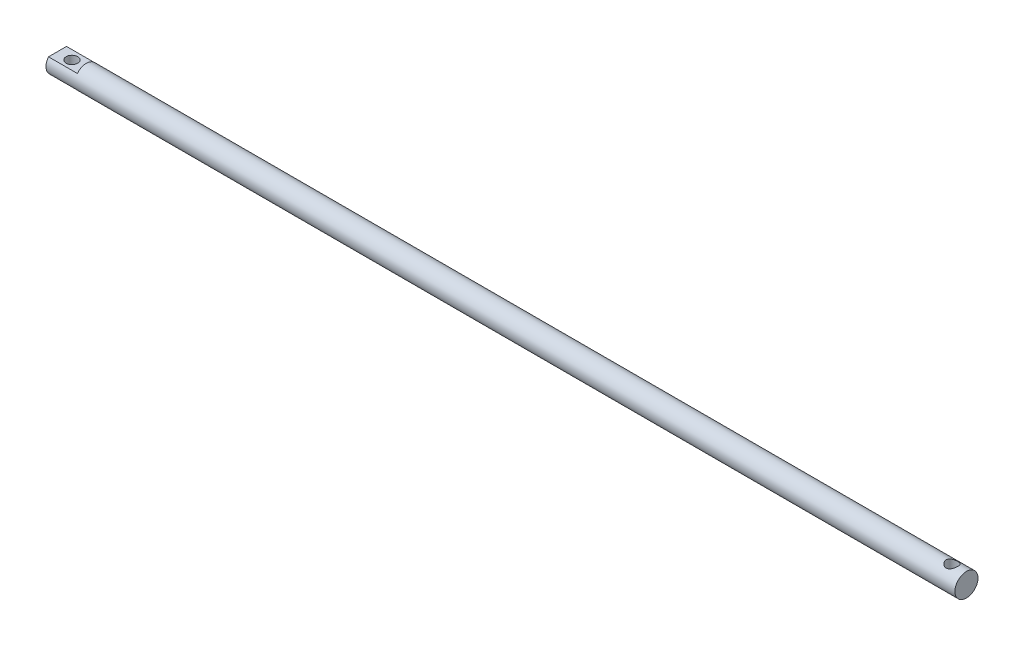
ISO-10303-21;
HEADER;
FILE_DESCRIPTION(('STEP AP214'),'2;1');
FILE_NAME('part.step','',(''),(''),'','','');
FILE_SCHEMA(('AUTOMOTIVE_DESIGN { 1 0 10303 214 1 1 1 1 }'));
ENDSEC;
DATA;
#1=APPLICATION_CONTEXT('core data for automotive mechanical design processes');
#2=APPLICATION_PROTOCOL_DEFINITION('international standard','automotive_design',2000,#1);
#3=PRODUCT_CONTEXT('',#1,'mechanical');
#4=PRODUCT('Part','Part','',(#3));
#5=PRODUCT_RELATED_PRODUCT_CATEGORY('part','',(#4));
#6=PRODUCT_DEFINITION_FORMATION('','',#4);
#7=PRODUCT_DEFINITION_CONTEXT('part definition',#1,'design');
#8=PRODUCT_DEFINITION('design','',#6,#7);
#9=PRODUCT_DEFINITION_SHAPE('','',#8);
#10=(LENGTH_UNIT() NAMED_UNIT(*) SI_UNIT(.MILLI.,.METRE.));
#11=(NAMED_UNIT(*) PLANE_ANGLE_UNIT() SI_UNIT($,.RADIAN.));
#12=(NAMED_UNIT(*) SI_UNIT($,.STERADIAN.) SOLID_ANGLE_UNIT());
#13=UNCERTAINTY_MEASURE_WITH_UNIT(LENGTH_MEASURE(1.E-05),#10,'distance_accuracy_value','');
#14=(GEOMETRIC_REPRESENTATION_CONTEXT(3) GLOBAL_UNCERTAINTY_ASSIGNED_CONTEXT((#13)) GLOBAL_UNIT_ASSIGNED_CONTEXT((#10,
#11,#12)) REPRESENTATION_CONTEXT('',''));
#15=CARTESIAN_POINT('',(0.,0.,0.));
#16=DIRECTION('',(0.,0.,1.));
#17=DIRECTION('',(1.,0.,0.));
#18=AXIS2_PLACEMENT_3D('',#15,#16,#17);
#19=CARTESIAN_POINT('',(630.,0.,0.));
#20=DIRECTION('',(-1.,0.,0.));
#21=DIRECTION('',(0.,0.,1.));
#22=AXIS2_PLACEMENT_3D('',#19,#20,#21);
#23=CYLINDRICAL_SURFACE('',#22,8.);
#24=CARTESIAN_POINT('',(620.,-6.92820323027551,3.99999999999999));
#25=CARTESIAN_POINT('',(620.104265325437,-6.92820386262827,3.99999950219344));
#26=CARTESIAN_POINT('',(620.208539926679,-6.93056511456489,3.99591763199539));
#27=CARTESIAN_POINT('',(620.4162841746,-6.93992172463862,3.97964472112407));
#28=CARTESIAN_POINT('',(620.519753423833,-6.94691924018482,3.96744990521398));
#29=CARTESIAN_POINT('',(620.72521084557,-6.96530330045204,3.9350853829752));
#30=CARTESIAN_POINT('',(620.827196433829,-6.97669672816264,3.91490316893161));
#31=CARTESIAN_POINT('',(621.028814001678,-7.00345973447506,3.86682062971256));
#32=CARTESIAN_POINT('',(621.128444938043,-7.01883104071992,3.8389169506412));
#33=CARTESIAN_POINT('',(621.421688966009,-7.06996541785761,3.74442772916635));
#34=CARTESIAN_POINT('',(621.610985856617,-7.11087904783326,3.66684915651284));
#35=CARTESIAN_POINT('',(621.973729563801,-7.20170927952069,3.48506075380106));
#36=CARTESIAN_POINT('',(622.147175522219,-7.25162636823863,3.38084948302613));
#37=CARTESIAN_POINT('',(622.489208494348,-7.35987226264081,3.13867639492102));
#38=CARTESIAN_POINT('',(622.656214866448,-7.41855528289905,2.99863981046007));
#39=CARTESIAN_POINT('',(622.965655240649,-7.53488657765781,2.69298354883075));
#40=CARTESIAN_POINT('',(623.108076985764,-7.59253432325008,2.52735118809494));
#41=CARTESIAN_POINT('',(623.304982066482,-7.67587593559649,2.25626437810996));
#42=CARTESIAN_POINT('',(623.369532261619,-7.70394919240217,2.15870290429521));
#43=CARTESIAN_POINT('',(623.490104440228,-7.7574419379606,1.9577742706589));
#44=CARTESIAN_POINT('',(623.546130046009,-7.78286255243592,1.85440960246331));
#45=CARTESIAN_POINT('',(623.649112781658,-7.83032159918278,1.64251485422612));
#46=CARTESIAN_POINT('',(623.69607005259,-7.8523600840649,1.53398485456807));
#47=CARTESIAN_POINT('',(623.780361948266,-7.89238619731917,1.31258580967497));
#48=CARTESIAN_POINT('',(623.817701987689,-7.91037610439246,1.19971924732424));
#49=CARTESIAN_POINT('',(623.880018294275,-7.94064573590695,0.978622575683345));
#50=CARTESIAN_POINT('',(623.905682153058,-7.95323930006916,0.870629018183781));
#51=CARTESIAN_POINT('',(623.947979707433,-7.97409583861316,0.6525240884358));
#52=CARTESIAN_POINT('',(623.964617821516,-7.98236093189931,0.542413779814487));
#53=CARTESIAN_POINT('',(623.988655866998,-7.99432715952591,0.320973525125407));
#54=CARTESIAN_POINT('',(623.996058446716,-7.99802960221736,0.209643937931292));
#55=CARTESIAN_POINT('',(624.00153168637,-8.0007656004484,-0.0132971447801192));
#56=CARTESIAN_POINT('',(623.999602917245,-7.99979944163708,-0.124908622632265));
#57=CARTESIAN_POINT('',(623.987014791293,-7.99351360464186,-0.337727985342387));
#58=CARTESIAN_POINT('',(623.977131977651,-7.98858118408678,-0.43899381771691));
#59=CARTESIAN_POINT('',(623.949736720904,-7.97497880011988,-0.640243249291336));
#60=CARTESIAN_POINT('',(623.932221820864,-7.96630763313356,-0.74022642489705));
#61=CARTESIAN_POINT('',(623.868489477306,-7.93497195498556,-1.03714138295467));
#62=CARTESIAN_POINT('',(623.811072102999,-7.9069787607081,-1.23123936013568));
#63=CARTESIAN_POINT('',(623.667666026114,-7.83886272517952,-1.60926871560137));
#64=CARTESIAN_POINT('',(623.581293017597,-7.79857742343274,-1.79302228049011));
#65=CARTESIAN_POINT('',(623.382948065529,-7.70950607728794,-2.14389861654607));
#66=CARTESIAN_POINT('',(623.270966957186,-7.66071699099023,-2.31101540282592));
#67=CARTESIAN_POINT('',(623.012415080003,-7.55377539869558,-2.64069813790283));
#68=CARTESIAN_POINT('',(622.863575239847,-7.49517374441382,-2.80134064782811));
#69=CARTESIAN_POINT('',(622.541653756814,-7.37817491997776,-3.09641313015096));
#70=CARTESIAN_POINT('',(622.368553637176,-7.31977794078034,-3.23082293513639));
#71=CARTESIAN_POINT('',(621.989357111332,-7.20576112808084,-3.4780361331416));
#72=CARTESIAN_POINT('',(621.781863381452,-7.15055315383101,-3.58892539602574));
#73=CARTESIAN_POINT('',(621.456582615561,-7.07886925416586,-3.72723782010751));
#74=CARTESIAN_POINT('',(621.345791640803,-7.05682593849465,-3.76867730715222));
#75=CARTESIAN_POINT('',(621.120255153219,-7.01731299636542,-3.84175062064904));
#76=CARTESIAN_POINT('',(621.005512127474,-6.99984055082838,-3.87339049322798));
#77=CARTESIAN_POINT('',(620.782171335483,-6.97140602598867,-3.92431909326376));
#78=CARTESIAN_POINT('',(620.67380134854,-6.96003957007805,-3.94438433855717));
#79=CARTESIAN_POINT('',(620.455419099522,-6.94230335544128,-3.97551851361913));
#80=CARTESIAN_POINT('',(620.345407721866,-6.93593099829036,-3.98659212183614));
#81=CARTESIAN_POINT('',(620.124707489967,-6.92844811909924,-3.99958291311108));
#82=CARTESIAN_POINT('',(620.014018903373,-6.92733563775176,-4.00150350567567));
#83=CARTESIAN_POINT('',(619.792943306894,-6.93041539174956,-3.99616718095744));
#84=CARTESIAN_POINT('',(619.682556277157,-6.93460726902939,-3.98891088315149));
#85=CARTESIAN_POINT('',(619.47513061602,-6.94737197203376,-3.96663154579714));
#86=CARTESIAN_POINT('',(619.377956788988,-6.95541341326253,-3.95254845698988));
#87=CARTESIAN_POINT('',(619.185268066566,-6.97528372672039,-3.91737385475212));
#88=CARTESIAN_POINT('',(619.089753729964,-6.98711384958698,-3.89628002700137));
#89=CARTESIAN_POINT('',(618.806631963892,-7.02775685901552,-3.82280238446318));
#90=CARTESIAN_POINT('',(618.622308565727,-7.06173163693375,-3.76020731695081));
#91=CARTESIAN_POINT('',(618.258325412299,-7.14144993292039,-3.60658595732558));
#92=CARTESIAN_POINT('',(618.079277046661,-7.18766564346823,-3.51437713951612));
#93=CARTESIAN_POINT('',(617.738129803313,-7.28624486618863,-3.30514737086273));
#94=CARTESIAN_POINT('',(617.576039696692,-7.33861153030437,-3.18811367399411));
#95=CARTESIAN_POINT('',(617.252086877142,-7.45151836616993,-2.91535761342629));
#96=CARTESIAN_POINT('',(617.092828412834,-7.51225675092662,-2.75661800037809));
#97=CARTESIAN_POINT('',(616.802334026584,-7.62937597657744,-2.41358105803057));
#98=CARTESIAN_POINT('',(616.671107570384,-7.68575534144674,-2.22927513013704));
#99=CARTESIAN_POINT('',(616.496792217763,-7.76335543938378,-1.9341922540815));
#100=CARTESIAN_POINT('',(616.441869942701,-7.78834354202674,-1.83122945254027));
#101=CARTESIAN_POINT('',(616.340994469123,-7.83494183925331,-1.62028527572801));
#102=CARTESIAN_POINT('',(616.295037236862,-7.85655355213899,-1.51230618469747));
#103=CARTESIAN_POINT('',(616.21262567336,-7.8957515201521,-1.29213403393071));
#104=CARTESIAN_POINT('',(616.17616684182,-7.91333968113672,-1.17994299872757));
#105=CARTESIAN_POINT('',(616.113192739054,-7.94396070933363,-0.952197786602007));
#106=CARTESIAN_POINT('',(616.086676288706,-7.95699411670659,-0.836644010238153));
#107=CARTESIAN_POINT('',(616.045927950053,-7.97711749125789,-0.613942900584725));
#108=CARTESIAN_POINT('',(616.030790527224,-7.98464383966398,-0.506999857370298));
#109=CARTESIAN_POINT('',(616.009207886647,-7.99539449729097,-0.291983714868753));
#110=CARTESIAN_POINT('',(616.002765563629,-7.99861737381754,-0.183910251308602));
#111=CARTESIAN_POINT('',(615.998669857914,-8.00066496370437,0.0323692027916044));
#112=CARTESIAN_POINT('',(616.001010388416,-7.99949272302419,0.14057504961526));
#113=CARTESIAN_POINT('',(616.014437670826,-7.99278884324615,0.356345776551083));
#114=CARTESIAN_POINT('',(616.025527627864,-7.9872556066098,0.463910407218392));
#115=CARTESIAN_POINT('',(616.05529397739,-7.97248705040341,0.670402230454391));
#116=CARTESIAN_POINT('',(616.073417848704,-7.96352188946078,0.7694287713797));
#117=CARTESIAN_POINT('',(616.116969937488,-7.94213883037983,0.965494016558211));
#118=CARTESIAN_POINT('',(616.142400649174,-7.92971975328176,1.06253202988242));
#119=CARTESIAN_POINT('',(616.229286595751,-7.88769036296796,1.34967669515379));
#120=CARTESIAN_POINT('',(616.30136154016,-7.85329454083083,1.53599051531896));
#121=CARTESIAN_POINT('',(616.474913777281,-7.77303546188783,1.90172389087133));
#122=CARTESIAN_POINT('',(616.577516772334,-7.72674465907379,2.08050775123495));
#123=CARTESIAN_POINT('',(616.807832244173,-7.62752535456451,2.41909138351713));
#124=CARTESIAN_POINT('',(616.935556253632,-7.57459380826237,2.57888238184506));
#125=CARTESIAN_POINT('',(617.227180136878,-7.46114622775075,2.89165430996831));
#126=CARTESIAN_POINT('',(617.393415226836,-7.40039963213061,3.04237488708298));
#127=CARTESIAN_POINT('',(617.749837638172,-7.28251536809496,3.31466901461287));
#128=CARTESIAN_POINT('',(617.940045925249,-7.22538092516391,3.43621677845463));
#129=CARTESIAN_POINT('',(618.243375736153,-7.14673032771599,3.59554085555897));
#130=CARTESIAN_POINT('',(618.349301068268,-7.12134958638074,3.64540546855453));
#131=CARTESIAN_POINT('',(618.565804376965,-7.07430377646636,3.7358834166029));
#132=CARTESIAN_POINT('',(618.676379922062,-7.05263679540785,3.77650151690077));
#133=CARTESIAN_POINT('',(618.901126299433,-7.01393620687007,3.84790167044832));
#134=CARTESIAN_POINT('',(619.015287034468,-6.99689069691892,3.87870902746068));
#135=CARTESIAN_POINT('',(619.246473715577,-6.96811827819218,3.9301656885662));
#136=CARTESIAN_POINT('',(619.363497598088,-6.95638765128934,3.95082209480825));
#137=CARTESIAN_POINT('',(619.567198309544,-6.9411803288909,3.97745846425996));
#138=CARTESIAN_POINT('',(619.653459372982,-6.93632575562014,3.98590343866332));
#139=CARTESIAN_POINT('',(619.826478127986,-6.92983683549392,3.99717460159987));
#140=CARTESIAN_POINT('',(619.913235852386,-6.92820270406464,4.00000041424856));
#141=CARTESIAN_POINT('',(620.,-6.92820323027551,3.99999999999999));
#142=B_SPLINE_CURVE_WITH_KNOTS('',3,(#24,#25,#26,#27,#28,#29,#30,#31,#32,#33,#34,#35,#36,#37,
#38,#39,#40,#41,#42,#43,#44,#45,#46,#47,#48,#49,#50,#51,#52,#53,#54,#55,#56,#57,#58,#59,#60,#61,
#62,#63,#64,#65,#66,#67,#68,#69,#70,#71,#72,#73,#74,#75,#76,#77,#78,#79,#80,#81,#82,#83,#84,#85,
#86,#87,#88,#89,#90,#91,#92,#93,#94,#95,#96,#97,#98,#99,#100,#101,#102,#103,#104,#105,#106,#107,
#108,#109,#110,#111,#112,#113,#114,#115,#116,#117,#118,#119,#120,#121,#122,#123,#124,#125,#126,
#127,#128,#129,#130,#131,#132,#133,#134,#135,#136,#137,#138,#139,#140,#141),.UNSPECIFIED.,.T.,
.F.,(4,2,2,2,2,2,2,2,2,2,2,2,2,2,2,2,2,2,2,2,2,2,2,2,2,2,2,2,2,2,2,2,2,2,2,2,2,2,2,2,2,2,2,2,2,
2,2,2,2,2,2,2,2,2,2,2,2,2,4),(0.,0.312705907645127,0.625557430139106,0.938900807369748,
1.25238050266333,1.8753233150872,2.49829983322605,3.17265818143843,3.84735177482024,
4.20786878872681,4.56823217961293,4.92858996431108,5.28874441516642,5.62343001077667,
5.95795161516739,6.29237727234825,6.6267824679036,6.93200651230817,7.23732888766057,
7.84737748897723,8.46586637752485,9.08457696228989,9.76177264655461,10.4394869181158,
11.1602386574569,11.5207615871967,11.8810616378013,12.2129840588139,12.5447336660447,
12.8763596865808,13.2079633222266,13.5031682056198,13.7984706362684,14.3886653967499,
15.0061951555508,15.6240427481094,16.319773042532,17.0157378984355,17.3733524504476,
17.7308057238246,18.0880893282017,18.44533054695,18.7697157004161,19.0942088199643,
19.4184770967801,19.7428642161658,20.0457160884446,20.3486714633267,20.9540518089476,
21.5853244972459,22.2168876724957,22.9113041424698,23.6063321822732,23.9652997079033,
24.3240818165632,24.6819309195697,25.0395292944429,25.2997293817867,25.5599468741983),.UNSPECIFIED.);
#143=CARTESIAN_POINT('',(620.,-6.92820323027551,3.99999999999999));
#144=VERTEX_POINT('',#143);
#145=EDGE_CURVE('E106',#144,#144,#142,.T.);
#146=ORIENTED_EDGE('',*,*,#145,.T.);
#147=EDGE_LOOP('',(#146));
#148=FACE_BOUND('',#147,.T.);
#149=CARTESIAN_POINT('',(620.,6.92820323027551,3.99999999999999));
#150=CARTESIAN_POINT('',(619.895734674563,6.92820386262827,3.99999950219344));
#151=CARTESIAN_POINT('',(619.791460073321,6.93056511456489,3.99591763199539));
#152=CARTESIAN_POINT('',(619.5837158254,6.93992172463862,3.97964472112407));
#153=CARTESIAN_POINT('',(619.480246576167,6.94691924018482,3.96744990521398));
#154=CARTESIAN_POINT('',(619.27478915443,6.96530330045204,3.9350853829752));
#155=CARTESIAN_POINT('',(619.17280356617,6.97669672816264,3.91490316893161));
#156=CARTESIAN_POINT('',(618.971185998322,7.00345973447506,3.86682062971256));
#157=CARTESIAN_POINT('',(618.871555061957,7.01883104071992,3.8389169506412));
#158=CARTESIAN_POINT('',(618.578311033991,7.06996541785761,3.74442772916635));
#159=CARTESIAN_POINT('',(618.389014143383,7.11087904783326,3.66684915651284));
#160=CARTESIAN_POINT('',(618.026270436199,7.20170927952069,3.48506075380106));
#161=CARTESIAN_POINT('',(617.852824477781,7.25162636823862,3.38084948302614));
#162=CARTESIAN_POINT('',(617.510791505652,7.35987226264081,3.13867639492104));
#163=CARTESIAN_POINT('',(617.343785133553,7.41855528289904,2.99863981046009));
#164=CARTESIAN_POINT('',(617.034344759351,7.5348865776578,2.69298354883079));
#165=CARTESIAN_POINT('',(616.891923014236,7.59253432325007,2.52735118809498));
#166=CARTESIAN_POINT('',(616.695017933518,7.67587593559649,2.25626437810994));
#167=CARTESIAN_POINT('',(616.630467738381,7.70394919240219,2.15870290429515));
#168=CARTESIAN_POINT('',(616.509895559772,7.75744193796062,1.95777427065883));
#169=CARTESIAN_POINT('',(616.453869953991,7.78286255243593,1.85440960246328));
#170=CARTESIAN_POINT('',(616.350887218342,7.83032159918278,1.64251485422613));
#171=CARTESIAN_POINT('',(616.30392994741,7.85236008406491,1.53398485456807));
#172=CARTESIAN_POINT('',(616.219638051734,7.89238619731918,1.31258580967496));
#173=CARTESIAN_POINT('',(616.182298012311,7.91037610439246,1.19971924732424));
#174=CARTESIAN_POINT('',(616.119981705725,7.94064573590695,0.978622575683346));
#175=CARTESIAN_POINT('',(616.094317846942,7.95323930006916,0.870629018183781));
#176=CARTESIAN_POINT('',(616.052020292567,7.97409583861316,0.6525240884358));
#177=CARTESIAN_POINT('',(616.035382178484,7.98236093189931,0.542413779814487));
#178=CARTESIAN_POINT('',(616.011344133002,7.99432715952591,0.320973525125406));
#179=CARTESIAN_POINT('',(616.003941553284,7.99802960221736,0.209643937931292));
#180=CARTESIAN_POINT('',(615.99846831363,8.0007656004484,-0.0132971447801192));
#181=CARTESIAN_POINT('',(616.000397082755,7.99979944163708,-0.124908622632265));
#182=CARTESIAN_POINT('',(616.012985208707,7.99351360464186,-0.337727985342387));
#183=CARTESIAN_POINT('',(616.022868022349,7.98858118408678,-0.43899381771691));
#184=CARTESIAN_POINT('',(616.050263279096,7.97497880011988,-0.640243249291336));
#185=CARTESIAN_POINT('',(616.067778179136,7.96630763313356,-0.74022642489705));
#186=CARTESIAN_POINT('',(616.131510522694,7.93497195498556,-1.03714138295467));
#187=CARTESIAN_POINT('',(616.188927897001,7.9069787607081,-1.23123936013568));
#188=CARTESIAN_POINT('',(616.332333973886,7.83886272517952,-1.60926871560137));
#189=CARTESIAN_POINT('',(616.418706982403,7.79857742343274,-1.79302228049011));
#190=CARTESIAN_POINT('',(616.617051934471,7.70950607728794,-2.14389861654607));
#191=CARTESIAN_POINT('',(616.729033042814,7.66071699099023,-2.31101540282592));
#192=CARTESIAN_POINT('',(616.987584919997,7.55377539869558,-2.64069813790283));
#193=CARTESIAN_POINT('',(617.136424760153,7.49517374441382,-2.80134064782811));
#194=CARTESIAN_POINT('',(617.458346243186,7.37817491997776,-3.09641313015096));
#195=CARTESIAN_POINT('',(617.631446362824,7.31977794078034,-3.23082293513639));
#196=CARTESIAN_POINT('',(618.010642888668,7.20576112808084,-3.4780361331416));
#197=CARTESIAN_POINT('',(618.218136618548,7.15055315383101,-3.58892539602574));
#198=CARTESIAN_POINT('',(618.543417384439,7.07886925416586,-3.72723782010751));
#199=CARTESIAN_POINT('',(618.654208359197,7.05682593849465,-3.76867730715222));
#200=CARTESIAN_POINT('',(618.879744846781,7.01731299636542,-3.84175062064904));
#201=CARTESIAN_POINT('',(618.994487872526,6.99984055082838,-3.87339049322798));
#202=CARTESIAN_POINT('',(619.217828664517,6.97140602598867,-3.92431909326376));
#203=CARTESIAN_POINT('',(619.32619865146,6.96003957007805,-3.94438433855717));
#204=CARTESIAN_POINT('',(619.544580900478,6.94230335544128,-3.97551851361913));
#205=CARTESIAN_POINT('',(619.654592278134,6.93593099829036,-3.98659212183614));
#206=CARTESIAN_POINT('',(619.875292510033,6.92844811909924,-3.99958291311108));
#207=CARTESIAN_POINT('',(619.985981096627,6.92733563775176,-4.00150350567567));
#208=CARTESIAN_POINT('',(620.207056693106,6.93041539174956,-3.99616718095744));
#209=CARTESIAN_POINT('',(620.317443722843,6.93460726902939,-3.98891088315149));
#210=CARTESIAN_POINT('',(620.52486938398,6.94737197203376,-3.96663154579714));
#211=CARTESIAN_POINT('',(620.622043211012,6.95541341326253,-3.95254845698988));
#212=CARTESIAN_POINT('',(620.814731933434,6.97528372672039,-3.91737385475212));
#213=CARTESIAN_POINT('',(620.910246270036,6.98711384958698,-3.89628002700137));
#214=CARTESIAN_POINT('',(621.193368036108,7.02775685901552,-3.82280238446318));
#215=CARTESIAN_POINT('',(621.377691434273,7.06173163693375,-3.76020731695081));
#216=CARTESIAN_POINT('',(621.741674587701,7.14144993292039,-3.60658595732558));
#217=CARTESIAN_POINT('',(621.920722953339,7.18766564346823,-3.51437713951612));
#218=CARTESIAN_POINT('',(622.261870196687,7.28624486618863,-3.30514737086273));
#219=CARTESIAN_POINT('',(622.423960303308,7.33861153030437,-3.18811367399411));
#220=CARTESIAN_POINT('',(622.747913122858,7.45151836616993,-2.91535761342629));
#221=CARTESIAN_POINT('',(622.907171587166,7.51225675092662,-2.75661800037809));
#222=CARTESIAN_POINT('',(623.197665973416,7.62937597657744,-2.41358105803057));
#223=CARTESIAN_POINT('',(623.328892429616,7.68575534144674,-2.22927513013704));
#224=CARTESIAN_POINT('',(623.503207782237,7.76335543938378,-1.9341922540815));
#225=CARTESIAN_POINT('',(623.558130057299,7.78834354202674,-1.83122945254027));
#226=CARTESIAN_POINT('',(623.659005530877,7.83494183925331,-1.62028527572801));
#227=CARTESIAN_POINT('',(623.704962763138,7.85655355213899,-1.51230618469747));
#228=CARTESIAN_POINT('',(623.78737432664,7.8957515201521,-1.29213403393071));
#229=CARTESIAN_POINT('',(623.82383315818,7.91333968113672,-1.17994299872757));
#230=CARTESIAN_POINT('',(623.886807260946,7.94396070933363,-0.952197786602007));
#231=CARTESIAN_POINT('',(623.913323711294,7.95699411670659,-0.836644010238153));
#232=CARTESIAN_POINT('',(623.954072049947,7.97711749125789,-0.613942900584721));
#233=CARTESIAN_POINT('',(623.969209472776,7.98464383966398,-0.506999857370291));
#234=CARTESIAN_POINT('',(623.990792113353,7.99539449729097,-0.291983714868746));
#235=CARTESIAN_POINT('',(623.997234436371,7.99861737381754,-0.183910251308599));
#236=CARTESIAN_POINT('',(624.001330142086,8.00066496370437,0.0323692027916044));
#237=CARTESIAN_POINT('',(623.998989611584,7.99949272302419,0.14057504961526));
#238=CARTESIAN_POINT('',(623.985562329174,7.99278884324615,0.356345776551083));
#239=CARTESIAN_POINT('',(623.974472372136,7.9872556066098,0.463910407218392));
#240=CARTESIAN_POINT('',(623.94470602261,7.97248705040341,0.670402230454392));
#241=CARTESIAN_POINT('',(623.926582151296,7.96352188946078,0.769428771379702));
#242=CARTESIAN_POINT('',(623.883030062512,7.94213883037983,0.965494016558213));
#243=CARTESIAN_POINT('',(623.857599350826,7.92971975328176,1.06253202988242));
#244=CARTESIAN_POINT('',(623.770713404249,7.88769036296796,1.34967669515379));
#245=CARTESIAN_POINT('',(623.69863845984,7.85329454083083,1.53599051531897));
#246=CARTESIAN_POINT('',(623.525086222719,7.77303546188784,1.90172389087132));
#247=CARTESIAN_POINT('',(623.422483227666,7.7267446590738,2.08050775123491));
#248=CARTESIAN_POINT('',(623.192167755827,7.62752535456452,2.41909138351709));
#249=CARTESIAN_POINT('',(623.064443746368,7.57459380826237,2.57888238184505));
#250=CARTESIAN_POINT('',(622.772819863122,7.46114622775078,2.89165430996824));
#251=CARTESIAN_POINT('',(622.606584773164,7.40039963213067,3.04237488708284));
#252=CARTESIAN_POINT('',(622.250162361828,7.28251536809501,3.31466901461276));
#253=CARTESIAN_POINT('',(622.059954074751,7.22538092516394,3.43621677845459));
#254=CARTESIAN_POINT('',(621.756624263847,7.14673032771599,3.59554085555897));
#255=CARTESIAN_POINT('',(621.650698931732,7.12134958638074,3.64540546855453));
#256=CARTESIAN_POINT('',(621.434195623035,7.07430377646636,3.73588341660289));
#257=CARTESIAN_POINT('',(621.323620077938,7.05263679540785,3.77650151690077));
#258=CARTESIAN_POINT('',(621.098873700567,7.01393620687008,3.8479016704483));
#259=CARTESIAN_POINT('',(620.984712965532,6.99689069691893,3.87870902746066));
#260=CARTESIAN_POINT('',(620.753526284423,6.96811827819219,3.93016568856619));
#261=CARTESIAN_POINT('',(620.636502401912,6.95638765128934,3.95082209480824));
#262=CARTESIAN_POINT('',(620.432801690456,6.9411803288909,3.97745846425996));
#263=CARTESIAN_POINT('',(620.346540627018,6.93632575562014,3.98590343866332));
#264=CARTESIAN_POINT('',(620.173521872014,6.92983683549392,3.99717460159987));
#265=CARTESIAN_POINT('',(620.086764147614,6.92820270406464,4.00000041424856));
#266=CARTESIAN_POINT('',(620.,6.92820323027551,3.99999999999999));
#267=B_SPLINE_CURVE_WITH_KNOTS('',3,(#149,#150,#151,#152,#153,#154,#155,#156,#157,#158,#159,
#160,#161,#162,#163,#164,#165,#166,#167,#168,#169,#170,#171,#172,#173,#174,#175,#176,#177,#178,
#179,#180,#181,#182,#183,#184,#185,#186,#187,#188,#189,#190,#191,#192,#193,#194,#195,#196,#197,
#198,#199,#200,#201,#202,#203,#204,#205,#206,#207,#208,#209,#210,#211,#212,#213,#214,#215,#216,
#217,#218,#219,#220,#221,#222,#223,#224,#225,#226,#227,#228,#229,#230,#231,#232,#233,#234,#235,
#236,#237,#238,#239,#240,#241,#242,#243,#244,#245,#246,#247,#248,#249,#250,#251,#252,#253,#254,
#255,#256,#257,#258,#259,#260,#261,#262,#263,#264,#265,#266),.UNSPECIFIED.,.T.,.F.,(4,2,2,2,2,2,
2,2,2,2,2,2,2,2,2,2,2,2,2,2,2,2,2,2,2,2,2,2,2,2,2,2,2,2,2,2,2,2,2,2,2,2,2,2,2,2,2,2,2,2,2,2,2,2,
2,2,2,2,4),(0.,0.312705907645127,0.625557430139106,0.938900807369748,1.25238050266333,
1.8753233150872,2.49829983322605,3.17265818143831,3.84735177482023,4.20786878872689,
4.56823217961292,4.92858996431107,5.28874441516641,5.62343001077666,5.95795161516738,
6.29237727234824,6.62678246790359,6.93200651230816,7.23732888766056,7.84737748897723,
8.46586637752484,9.08457696228988,9.7617726465546,10.4394869181158,11.1602386574569,
11.5207615871967,11.8810616378013,12.2129840588139,12.5447336660447,12.8763596865808,
13.2079633222265,13.5031682056197,13.7984706362684,14.3886653967499,15.0061951555508,
15.6240427481093,16.319773042532,17.0157378984355,17.3733524504476,17.7308057238246,
18.0880893282017,18.44533054695,18.7697157004161,19.0942088199643,19.4184770967801,
19.7428642161658,20.0457160884446,20.3486714633267,20.9540518089476,21.5853244972459,
22.2168876724957,22.9113041424695,23.6063321822732,23.9652997079032,24.3240818165632,
24.6819309195696,25.0395292944429,25.2997293817866,25.5599468741983),.UNSPECIFIED.);
#268=CARTESIAN_POINT('',(620.,6.92820323027551,3.99999999999999));
#269=VERTEX_POINT('',#268);
#270=EDGE_CURVE('E100',#269,#269,#267,.T.);
#271=ORIENTED_EDGE('',*,*,#270,.T.);
#272=EDGE_LOOP('',(#271));
#273=FACE_BOUND('',#272,.T.);
#274=CARTESIAN_POINT('',(630.,0.,0.));
#275=DIRECTION('',(1.,0.,0.));
#276=DIRECTION('',(0.,0.,-1.));
#277=AXIS2_PLACEMENT_3D('',#274,#275,#276);
#278=CIRCLE('',#277,8.);
#279=CARTESIAN_POINT('',(630.,0.,-8.));
#280=VERTEX_POINT('',#279);
#281=EDGE_CURVE('E95',#280,#280,#278,.T.);
#282=ORIENTED_EDGE('',*,*,#281,.F.);
#283=EDGE_LOOP('',(#282));
#284=FACE_BOUND('',#283,.T.);
#285=DIRECTION('',(-1.,0.,0.));
#286=VECTOR('',#285,1.);
#287=CARTESIAN_POINT('',(630.,5.,-6.2449979983984));
#288=LINE('',#287,#286);
#289=CARTESIAN_POINT('',(20.,5.,-6.2449979983984));
#290=VERTEX_POINT('',#289);
#291=CARTESIAN_POINT('',(0.,5.,-6.2449979983984));
#292=VERTEX_POINT('',#291);
#293=EDGE_CURVE('E59',#290,#292,#288,.T.);
#294=ORIENTED_EDGE('',*,*,#293,.F.);
#295=CARTESIAN_POINT('',(20.,0.,0.));
#296=DIRECTION('',(-1.,0.,0.));
#297=DIRECTION('',(0.,0.,1.));
#298=AXIS2_PLACEMENT_3D('',#295,#296,#297);
#299=CIRCLE('',#298,8.);
#300=CARTESIAN_POINT('',(20.,5.,6.2449979983984));
#301=VERTEX_POINT('',#300);
#302=EDGE_CURVE('E12',#301,#290,#299,.T.);
#303=ORIENTED_EDGE('',*,*,#302,.F.);
#304=DIRECTION('',(-1.,0.,0.));
#305=VECTOR('',#304,1.);
#306=CARTESIAN_POINT('',(630.,5.,6.2449979983984));
#307=LINE('',#306,#305);
#308=CARTESIAN_POINT('',(0.,5.,6.2449979983984));
#309=VERTEX_POINT('',#308);
#310=EDGE_CURVE('E96',#309,#301,#307,.F.);
#311=ORIENTED_EDGE('',*,*,#310,.F.);
#312=CARTESIAN_POINT('',(0.,0.,0.));
#313=DIRECTION('',(1.,0.,0.));
#314=DIRECTION('',(0.,0.,-1.));
#315=AXIS2_PLACEMENT_3D('',#312,#313,#314);
#316=CIRCLE('',#315,8.);
#317=CARTESIAN_POINT('',(0.,-5.,6.2449979983984));
#318=VERTEX_POINT('',#317);
#319=EDGE_CURVE('E93',#309,#318,#316,.T.);
#320=ORIENTED_EDGE('',*,*,#319,.T.);
#321=DIRECTION('',(-1.,0.,0.));
#322=VECTOR('',#321,1.);
#323=CARTESIAN_POINT('',(630.,-5.,6.2449979983984));
#324=LINE('',#323,#322);
#325=CARTESIAN_POINT('',(20.,-5.,6.2449979983984));
#326=VERTEX_POINT('',#325);
#327=EDGE_CURVE('E51',#326,#318,#324,.T.);
#328=ORIENTED_EDGE('',*,*,#327,.F.);
#329=CARTESIAN_POINT('',(20.,-5.,-6.2449979983984));
#330=VERTEX_POINT('',#329);
#331=EDGE_CURVE('E40',#330,#326,#299,.T.);
#332=ORIENTED_EDGE('',*,*,#331,.F.);
#333=DIRECTION('',(-1.,0.,0.));
#334=VECTOR('',#333,1.);
#335=CARTESIAN_POINT('',(630.,-5.,-6.2449979983984));
#336=LINE('',#335,#334);
#337=CARTESIAN_POINT('',(0.,-5.,-6.2449979983984));
#338=VERTEX_POINT('',#337);
#339=EDGE_CURVE('E78',#338,#330,#336,.F.);
#340=ORIENTED_EDGE('',*,*,#339,.F.);
#341=EDGE_CURVE('E89',#338,#292,#316,.T.);
#342=ORIENTED_EDGE('',*,*,#341,.T.);
#343=EDGE_LOOP('',(#294,#303,#311,#320,#328,#332,#340,#342));
#344=FACE_BOUND('',#343,.T.);
#345=ADVANCED_FACE('F36',(#148,#273,#284,#344),#23,.T.);
#346=CARTESIAN_POINT('',(0.,0.,0.));
#347=DIRECTION('',(1.,0.,0.));
#348=DIRECTION('',(0.,0.,-1.));
#349=AXIS2_PLACEMENT_3D('',#346,#347,#348);
#350=PLANE('',#349);
#351=DIRECTION('',(0.,0.,-1.));
#352=VECTOR('',#351,1.);
#353=CARTESIAN_POINT('',(0.,5.,-10.));
#354=LINE('',#353,#352);
#355=EDGE_CURVE('E84',#309,#292,#354,.T.);
#356=ORIENTED_EDGE('',*,*,#355,.T.);
#357=ORIENTED_EDGE('',*,*,#341,.F.);
#358=DIRECTION('',(0.,0.,1.));
#359=VECTOR('',#358,1.);
#360=CARTESIAN_POINT('',(0.,-5.,-10.));
#361=LINE('',#360,#359);
#362=EDGE_CURVE('E75',#338,#318,#361,.T.);
#363=ORIENTED_EDGE('',*,*,#362,.T.);
#364=ORIENTED_EDGE('',*,*,#319,.F.);
#365=EDGE_LOOP('',(#356,#357,#363,#364));
#366=FACE_BOUND('',#365,.T.);
#367=ADVANCED_FACE('F92',(#366),#350,.F.);
#368=CARTESIAN_POINT('',(630.,0.,0.));
#369=DIRECTION('',(1.,0.,0.));
#370=DIRECTION('',(0.,0.,-1.));
#371=AXIS2_PLACEMENT_3D('',#368,#369,#370);
#372=PLANE('',#371);
#373=ORIENTED_EDGE('',*,*,#281,.T.);
#374=EDGE_LOOP('',(#373));
#375=FACE_BOUND('',#374,.T.);
#376=ADVANCED_FACE('F115',(#375),#372,.T.);
#377=CARTESIAN_POINT('',(620.,-8.,0.));
#378=DIRECTION('',(0.,1.,0.));
#379=DIRECTION('',(0.,0.,1.));
#380=AXIS2_PLACEMENT_3D('',#377,#378,#379);
#381=CYLINDRICAL_SURFACE('',#380,3.99999999999999);
#382=ORIENTED_EDGE('',*,*,#270,.F.);
#383=EDGE_LOOP('',(#382));
#384=FACE_BOUND('',#383,.T.);
#385=ORIENTED_EDGE('',*,*,#145,.F.);
#386=EDGE_LOOP('',(#385));
#387=FACE_BOUND('',#386,.T.);
#388=ADVANCED_FACE('F110',(#384,#387),#381,.F.);
#389=CARTESIAN_POINT('',(20.,-5.,-10.));
#390=DIRECTION('',(0.,-1.,0.));
#391=DIRECTION('',(0.,0.,-1.));
#392=AXIS2_PLACEMENT_3D('',#389,#390,#391);
#393=PLANE('',#392);
#394=CARTESIAN_POINT('',(10.,-5.,0.));
#395=DIRECTION('',(0.,-1.,0.));
#396=DIRECTION('',(0.,0.,-1.));
#397=AXIS2_PLACEMENT_3D('',#394,#395,#396);
#398=CIRCLE('',#397,4.);
#399=CARTESIAN_POINT('',(10.,-5.,-4.));
#400=VERTEX_POINT('',#399);
#401=EDGE_CURVE('E90',#400,#400,#398,.F.);
#402=ORIENTED_EDGE('',*,*,#401,.T.);
#403=EDGE_LOOP('',(#402));
#404=FACE_BOUND('',#403,.T.);
#405=ORIENTED_EDGE('',*,*,#327,.T.);
#406=ORIENTED_EDGE('',*,*,#362,.F.);
#407=ORIENTED_EDGE('',*,*,#339,.T.);
#408=DIRECTION('',(0.,0.,1.));
#409=VECTOR('',#408,1.);
#410=CARTESIAN_POINT('',(20.,-5.,-10.));
#411=LINE('',#410,#409);
#412=EDGE_CURVE('E144',#330,#326,#411,.T.);
#413=ORIENTED_EDGE('',*,*,#412,.T.);
#414=EDGE_LOOP('',(#405,#406,#407,#413));
#415=FACE_BOUND('',#414,.T.);
#416=ADVANCED_FACE('F77',(#404,#415),#393,.T.);
#417=CARTESIAN_POINT('',(20.,0.,0.));
#418=DIRECTION('',(-1.,0.,0.));
#419=DIRECTION('',(0.,0.,1.));
#420=AXIS2_PLACEMENT_3D('',#417,#418,#419);
#421=PLANE('',#420);
#422=ORIENTED_EDGE('',*,*,#331,.T.);
#423=ORIENTED_EDGE('',*,*,#412,.F.);
#424=EDGE_LOOP('',(#422,#423));
#425=FACE_BOUND('',#424,.T.);
#426=ADVANCED_FACE('F143',(#425),#421,.T.);
#427=ORIENTED_EDGE('',*,*,#302,.T.);
#428=DIRECTION('',(0.,0.,-1.));
#429=VECTOR('',#428,1.);
#430=CARTESIAN_POINT('',(20.,5.,-10.));
#431=LINE('',#430,#429);
#432=EDGE_CURVE('E145',#301,#290,#431,.T.);
#433=ORIENTED_EDGE('',*,*,#432,.F.);
#434=EDGE_LOOP('',(#427,#433));
#435=FACE_BOUND('',#434,.T.);
#436=ADVANCED_FACE('F117',(#435),#421,.T.);
#437=CARTESIAN_POINT('',(20.,5.,-10.));
#438=DIRECTION('',(0.,1.,0.));
#439=DIRECTION('',(0.,0.,1.));
#440=AXIS2_PLACEMENT_3D('',#437,#438,#439);
#441=PLANE('',#440);
#442=CARTESIAN_POINT('',(10.,5.,0.));
#443=DIRECTION('',(0.,1.,0.));
#444=DIRECTION('',(0.,0.,1.));
#445=AXIS2_PLACEMENT_3D('',#442,#443,#444);
#446=CIRCLE('',#445,4.);
#447=CARTESIAN_POINT('',(10.,5.,4.));
#448=VERTEX_POINT('',#447);
#449=EDGE_CURVE('E148',#448,#448,#446,.F.);
#450=ORIENTED_EDGE('',*,*,#449,.T.);
#451=EDGE_LOOP('',(#450));
#452=FACE_BOUND('',#451,.T.);
#453=ORIENTED_EDGE('',*,*,#293,.T.);
#454=ORIENTED_EDGE('',*,*,#355,.F.);
#455=ORIENTED_EDGE('',*,*,#310,.T.);
#456=ORIENTED_EDGE('',*,*,#432,.T.);
#457=EDGE_LOOP('',(#453,#454,#455,#456));
#458=FACE_BOUND('',#457,.T.);
#459=ADVANCED_FACE('F123',(#452,#458),#441,.T.);
#460=CARTESIAN_POINT('',(10.,-8.,0.));
#461=DIRECTION('',(0.,1.,0.));
#462=DIRECTION('',(0.,0.,1.));
#463=AXIS2_PLACEMENT_3D('',#460,#461,#462);
#464=CYLINDRICAL_SURFACE('',#463,4.);
#465=ORIENTED_EDGE('',*,*,#401,.F.);
#466=EDGE_LOOP('',(#465));
#467=FACE_BOUND('',#466,.T.);
#468=ORIENTED_EDGE('',*,*,#449,.F.);
#469=EDGE_LOOP('',(#468));
#470=FACE_BOUND('',#469,.T.);
#471=ADVANCED_FACE('F119',(#467,#470),#464,.F.);
#472=CLOSED_SHELL('',(#345,#367,#376,#388,#416,#426,#436,#459,#471));
#473=MANIFOLD_SOLID_BREP('B2',#472);
#474=ADVANCED_BREP_SHAPE_REPRESENTATION('',(#18,#473),#14);
#475=SHAPE_DEFINITION_REPRESENTATION(#9,#474);
ENDSEC;
END-ISO-10303-21;
